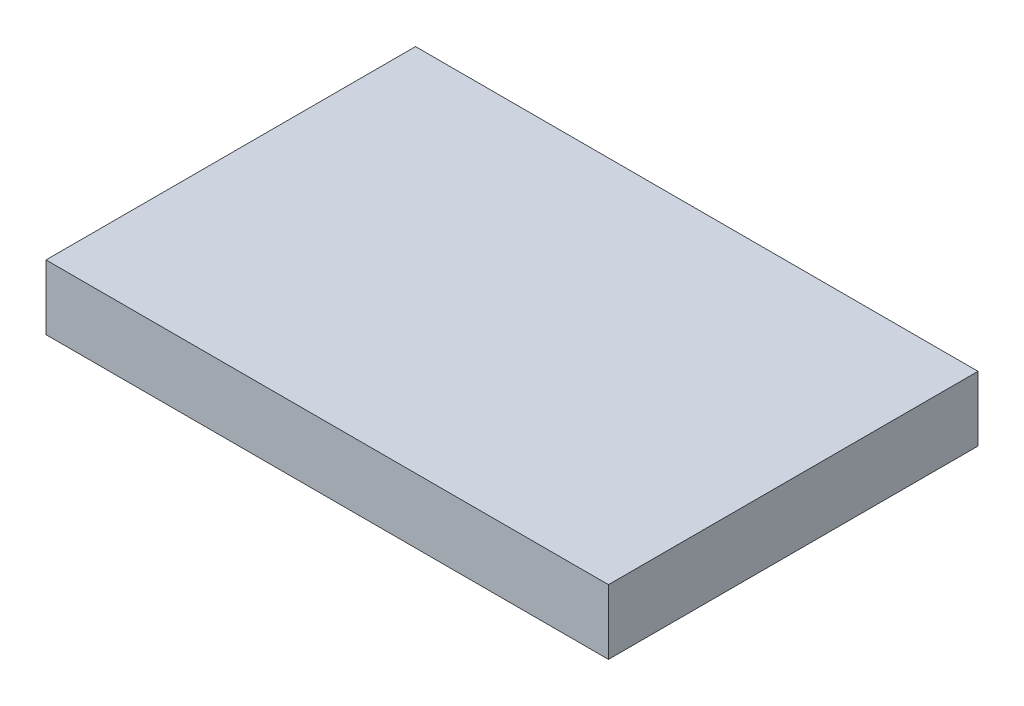
ISO-10303-21;
HEADER;
FILE_DESCRIPTION(('STEP AP214'),'2;1');
FILE_NAME('part.step','',(''),(''),'','','');
FILE_SCHEMA(('AUTOMOTIVE_DESIGN { 1 0 10303 214 1 1 1 1 }'));
ENDSEC;
DATA;
#1=APPLICATION_CONTEXT('core data for automotive mechanical design processes');
#2=APPLICATION_PROTOCOL_DEFINITION('international standard','automotive_design',2000,#1);
#3=PRODUCT_CONTEXT('',#1,'mechanical');
#4=PRODUCT('Part','Part','',(#3));
#5=PRODUCT_RELATED_PRODUCT_CATEGORY('part','',(#4));
#6=PRODUCT_DEFINITION_FORMATION('','',#4);
#7=PRODUCT_DEFINITION_CONTEXT('part definition',#1,'design');
#8=PRODUCT_DEFINITION('design','',#6,#7);
#9=PRODUCT_DEFINITION_SHAPE('','',#8);
#10=(LENGTH_UNIT() NAMED_UNIT(*) SI_UNIT(.MILLI.,.METRE.));
#11=(NAMED_UNIT(*) PLANE_ANGLE_UNIT() SI_UNIT($,.RADIAN.));
#12=(NAMED_UNIT(*) SI_UNIT($,.STERADIAN.) SOLID_ANGLE_UNIT());
#13=UNCERTAINTY_MEASURE_WITH_UNIT(LENGTH_MEASURE(1.E-05),#10,'distance_accuracy_value','');
#14=(GEOMETRIC_REPRESENTATION_CONTEXT(3) GLOBAL_UNCERTAINTY_ASSIGNED_CONTEXT((#13)) GLOBAL_UNIT_ASSIGNED_CONTEXT((#10,
#11,#12)) REPRESENTATION_CONTEXT('',''));
#15=CARTESIAN_POINT('',(0.,0.,0.));
#16=DIRECTION('',(0.,0.,1.));
#17=DIRECTION('',(1.,0.,0.));
#18=AXIS2_PLACEMENT_3D('',#15,#16,#17);
#19=CARTESIAN_POINT('',(0.,9.9,0.));
#20=DIRECTION('',(1.,0.,0.));
#21=DIRECTION('',(0.,0.,-1.));
#22=AXIS2_PLACEMENT_3D('',#19,#20,#21);
#23=PLANE('',#22);
#24=DIRECTION('',(0.,0.,1.));
#25=VECTOR('',#24,1.);
#26=CARTESIAN_POINT('',(0.,0.,0.));
#27=LINE('',#26,#25);
#28=CARTESIAN_POINT('',(0.,0.,-56.5));
#29=VERTEX_POINT('',#28);
#30=CARTESIAN_POINT('',(0.,0.,0.));
#31=VERTEX_POINT('',#30);
#32=EDGE_CURVE('E107',#29,#31,#27,.T.);
#33=ORIENTED_EDGE('',*,*,#32,.T.);
#34=DIRECTION('',(0.,-1.,0.));
#35=VECTOR('',#34,1.);
#36=CARTESIAN_POINT('',(0.,9.9,0.));
#37=LINE('',#36,#35);
#38=CARTESIAN_POINT('',(0.,9.9,0.));
#39=VERTEX_POINT('',#38);
#40=EDGE_CURVE('E11',#39,#31,#37,.T.);
#41=ORIENTED_EDGE('',*,*,#40,.F.);
#42=DIRECTION('',(0.,0.,1.));
#43=VECTOR('',#42,1.);
#44=CARTESIAN_POINT('',(0.,9.9,0.));
#45=LINE('',#44,#43);
#46=CARTESIAN_POINT('',(0.,9.9,-56.5));
#47=VERTEX_POINT('',#46);
#48=EDGE_CURVE('E91',#47,#39,#45,.T.);
#49=ORIENTED_EDGE('',*,*,#48,.F.);
#50=DIRECTION('',(0.,-1.,0.));
#51=VECTOR('',#50,1.);
#52=CARTESIAN_POINT('',(0.,9.9,-56.5));
#53=LINE('',#52,#51);
#54=EDGE_CURVE('E103',#47,#29,#53,.T.);
#55=ORIENTED_EDGE('',*,*,#54,.T.);
#56=EDGE_LOOP('',(#33,#41,#49,#55));
#57=FACE_BOUND('',#56,.T.);
#58=ADVANCED_FACE('F39',(#57),#23,.F.);
#59=CARTESIAN_POINT('',(0.,9.9,0.));
#60=DIRECTION('',(0.,0.,-1.));
#61=DIRECTION('',(-1.,0.,0.));
#62=AXIS2_PLACEMENT_3D('',#59,#60,#61);
#63=PLANE('',#62);
#64=DIRECTION('',(1.,0.,0.));
#65=VECTOR('',#64,1.);
#66=CARTESIAN_POINT('',(0.,0.,0.));
#67=LINE('',#66,#65);
#68=CARTESIAN_POINT('',(86.,0.,0.));
#69=VERTEX_POINT('',#68);
#70=EDGE_CURVE('E96',#31,#69,#67,.T.);
#71=ORIENTED_EDGE('',*,*,#70,.T.);
#72=DIRECTION('',(0.,-1.,0.));
#73=VECTOR('',#72,1.);
#74=CARTESIAN_POINT('',(86.,9.9,0.));
#75=LINE('',#74,#73);
#76=CARTESIAN_POINT('',(86.,9.9,0.));
#77=VERTEX_POINT('',#76);
#78=EDGE_CURVE('E48',#77,#69,#75,.T.);
#79=ORIENTED_EDGE('',*,*,#78,.F.);
#80=DIRECTION('',(1.,0.,0.));
#81=VECTOR('',#80,1.);
#82=CARTESIAN_POINT('',(0.,9.9,0.));
#83=LINE('',#82,#81);
#84=EDGE_CURVE('E86',#39,#77,#83,.T.);
#85=ORIENTED_EDGE('',*,*,#84,.F.);
#86=ORIENTED_EDGE('',*,*,#40,.T.);
#87=EDGE_LOOP('',(#71,#79,#85,#86));
#88=FACE_BOUND('',#87,.T.);
#89=ADVANCED_FACE('F95',(#88),#63,.F.);
#90=CARTESIAN_POINT('',(86.,9.9,0.));
#91=DIRECTION('',(-1.,0.,0.));
#92=DIRECTION('',(0.,0.,1.));
#93=AXIS2_PLACEMENT_3D('',#90,#91,#92);
#94=PLANE('',#93);
#95=DIRECTION('',(0.,0.,-1.));
#96=VECTOR('',#95,1.);
#97=CARTESIAN_POINT('',(86.,0.,0.));
#98=LINE('',#97,#96);
#99=CARTESIAN_POINT('',(86.,0.,-56.5));
#100=VERTEX_POINT('',#99);
#101=EDGE_CURVE('E73',#69,#100,#98,.T.);
#102=ORIENTED_EDGE('',*,*,#101,.T.);
#103=DIRECTION('',(0.,-1.,0.));
#104=VECTOR('',#103,1.);
#105=CARTESIAN_POINT('',(86.,9.9,-56.5));
#106=LINE('',#105,#104);
#107=CARTESIAN_POINT('',(86.,9.9,-56.5));
#108=VERTEX_POINT('',#107);
#109=EDGE_CURVE('E98',#108,#100,#106,.T.);
#110=ORIENTED_EDGE('',*,*,#109,.F.);
#111=DIRECTION('',(0.,0.,-1.));
#112=VECTOR('',#111,1.);
#113=CARTESIAN_POINT('',(86.,9.9,0.));
#114=LINE('',#113,#112);
#115=EDGE_CURVE('E89',#77,#108,#114,.T.);
#116=ORIENTED_EDGE('',*,*,#115,.F.);
#117=ORIENTED_EDGE('',*,*,#78,.T.);
#118=EDGE_LOOP('',(#102,#110,#116,#117));
#119=FACE_BOUND('',#118,.T.);
#120=ADVANCED_FACE('F99',(#119),#94,.F.);
#121=CARTESIAN_POINT('',(0.,9.9,-56.5));
#122=DIRECTION('',(0.,0.,1.));
#123=DIRECTION('',(1.,0.,0.));
#124=AXIS2_PLACEMENT_3D('',#121,#122,#123);
#125=PLANE('',#124);
#126=DIRECTION('',(-1.,0.,0.));
#127=VECTOR('',#126,1.);
#128=CARTESIAN_POINT('',(0.,0.,-56.5));
#129=LINE('',#128,#127);
#130=EDGE_CURVE('E79',#100,#29,#129,.T.);
#131=ORIENTED_EDGE('',*,*,#130,.T.);
#132=ORIENTED_EDGE('',*,*,#54,.F.);
#133=DIRECTION('',(-1.,0.,0.));
#134=VECTOR('',#133,1.);
#135=CARTESIAN_POINT('',(0.,9.9,-56.5));
#136=LINE('',#135,#134);
#137=EDGE_CURVE('E56',#108,#47,#136,.T.);
#138=ORIENTED_EDGE('',*,*,#137,.F.);
#139=ORIENTED_EDGE('',*,*,#109,.T.);
#140=EDGE_LOOP('',(#131,#132,#138,#139));
#141=FACE_BOUND('',#140,.T.);
#142=ADVANCED_FACE('F120',(#141),#125,.F.);
#143=CARTESIAN_POINT('',(0.,9.9,0.));
#144=DIRECTION('',(0.,-1.,0.));
#145=DIRECTION('',(0.,0.,-1.));
#146=AXIS2_PLACEMENT_3D('',#143,#144,#145);
#147=PLANE('',#146);
#148=ORIENTED_EDGE('',*,*,#48,.T.);
#149=ORIENTED_EDGE('',*,*,#84,.T.);
#150=ORIENTED_EDGE('',*,*,#115,.T.);
#151=ORIENTED_EDGE('',*,*,#137,.T.);
#152=EDGE_LOOP('',(#148,#149,#150,#151));
#153=FACE_BOUND('',#152,.T.);
#154=ADVANCED_FACE('F87',(#153),#147,.F.);
#155=CARTESIAN_POINT('',(0.,0.,0.));
#156=DIRECTION('',(0.,-1.,0.));
#157=DIRECTION('',(0.,0.,-1.));
#158=AXIS2_PLACEMENT_3D('',#155,#156,#157);
#159=PLANE('',#158);
#160=ORIENTED_EDGE('',*,*,#32,.F.);
#161=ORIENTED_EDGE('',*,*,#130,.F.);
#162=ORIENTED_EDGE('',*,*,#101,.F.);
#163=ORIENTED_EDGE('',*,*,#70,.F.);
#164=EDGE_LOOP('',(#160,#161,#162,#163));
#165=FACE_BOUND('',#164,.T.);
#166=ADVANCED_FACE('F123',(#165),#159,.T.);
#167=CLOSED_SHELL('',(#58,#89,#120,#142,#154,#166));
#168=MANIFOLD_SOLID_BREP('B2',#167);
#169=ADVANCED_BREP_SHAPE_REPRESENTATION('',(#18,#168),#14);
#170=SHAPE_DEFINITION_REPRESENTATION(#9,#169);
ENDSEC;
END-ISO-10303-21;
